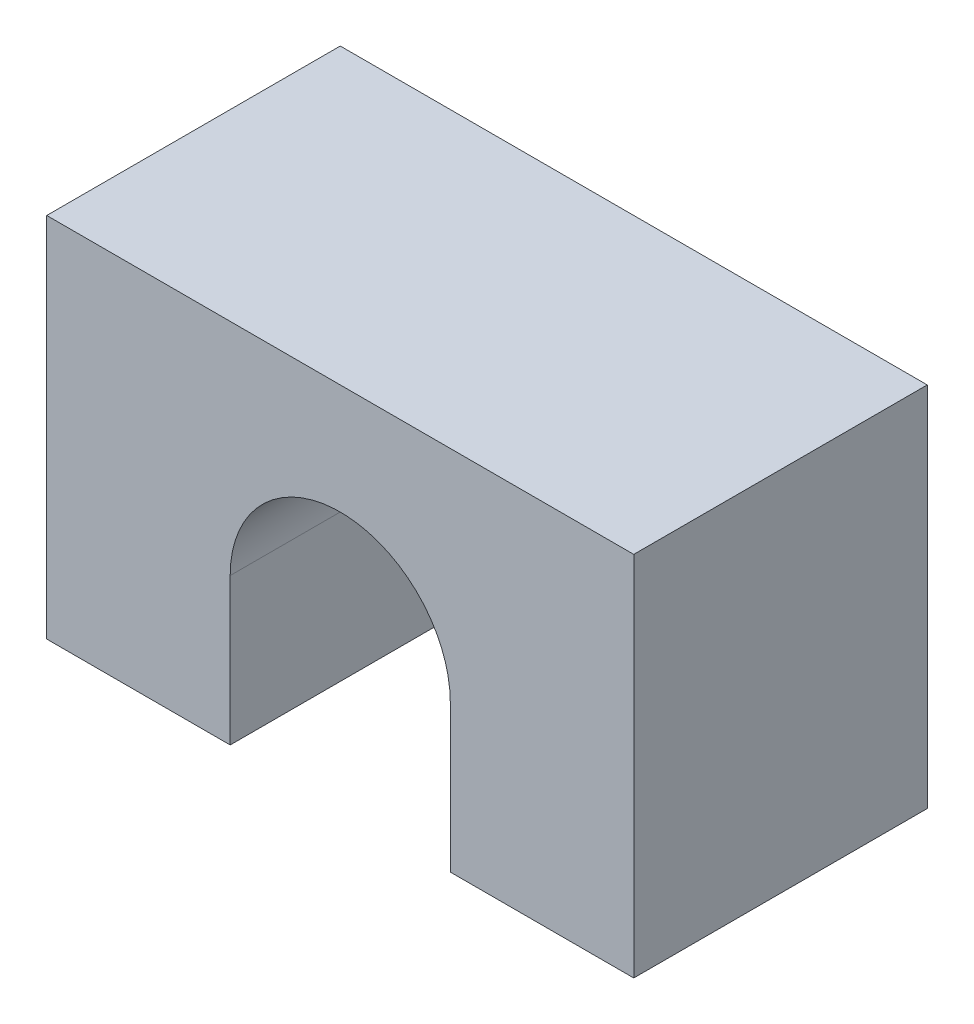
ISO-10303-21;
HEADER;
FILE_DESCRIPTION(('STEP AP214'),'2;1');
FILE_NAME('part.step','',(''),(''),'','','');
FILE_SCHEMA(('AUTOMOTIVE_DESIGN { 1 0 10303 214 1 1 1 1 }'));
ENDSEC;
DATA;
#1=APPLICATION_CONTEXT('core data for automotive mechanical design processes');
#2=APPLICATION_PROTOCOL_DEFINITION('international standard','automotive_design',2000,#1);
#3=PRODUCT_CONTEXT('',#1,'mechanical');
#4=PRODUCT('Part','Part','',(#3));
#5=PRODUCT_RELATED_PRODUCT_CATEGORY('part','',(#4));
#6=PRODUCT_DEFINITION_FORMATION('','',#4);
#7=PRODUCT_DEFINITION_CONTEXT('part definition',#1,'design');
#8=PRODUCT_DEFINITION('design','',#6,#7);
#9=PRODUCT_DEFINITION_SHAPE('','',#8);
#10=(LENGTH_UNIT() NAMED_UNIT(*) SI_UNIT(.MILLI.,.METRE.));
#11=(NAMED_UNIT(*) PLANE_ANGLE_UNIT() SI_UNIT($,.RADIAN.));
#12=(NAMED_UNIT(*) SI_UNIT($,.STERADIAN.) SOLID_ANGLE_UNIT());
#13=UNCERTAINTY_MEASURE_WITH_UNIT(LENGTH_MEASURE(1.E-05),#10,'distance_accuracy_value','');
#14=(GEOMETRIC_REPRESENTATION_CONTEXT(3) GLOBAL_UNCERTAINTY_ASSIGNED_CONTEXT((#13)) GLOBAL_UNIT_ASSIGNED_CONTEXT((#10,
#11,#12)) REPRESENTATION_CONTEXT('',''));
#15=CARTESIAN_POINT('',(0.,0.,0.));
#16=DIRECTION('',(0.,0.,1.));
#17=DIRECTION('',(1.,0.,0.));
#18=AXIS2_PLACEMENT_3D('',#15,#16,#17);
#19=CARTESIAN_POINT('',(0.,0.,8.));
#20=DIRECTION('',(0.,0.,-1.));
#21=DIRECTION('',(-1.,0.,0.));
#22=AXIS2_PLACEMENT_3D('',#19,#20,#21);
#23=CYLINDRICAL_SURFACE('',#22,3.);
#24=CARTESIAN_POINT('',(0.,0.,0.));
#25=DIRECTION('',(0.,0.,-1.));
#26=DIRECTION('',(1.,0.,0.));
#27=AXIS2_PLACEMENT_3D('',#24,#25,#26);
#28=CIRCLE('',#27,3.);
#29=CARTESIAN_POINT('',(-3.,0.,0.));
#30=VERTEX_POINT('',#29);
#31=CARTESIAN_POINT('',(3.,0.,0.));
#32=VERTEX_POINT('',#31);
#33=EDGE_CURVE('E129',#30,#32,#28,.T.);
#34=ORIENTED_EDGE('',*,*,#33,.T.);
#35=DIRECTION('',(0.,0.,-1.));
#36=VECTOR('',#35,1.);
#37=CARTESIAN_POINT('',(3.,0.,8.));
#38=LINE('',#37,#36);
#39=CARTESIAN_POINT('',(3.,0.,8.));
#40=VERTEX_POINT('',#39);
#41=EDGE_CURVE('E11',#40,#32,#38,.T.);
#42=ORIENTED_EDGE('',*,*,#41,.F.);
#43=CARTESIAN_POINT('',(0.,0.,8.));
#44=DIRECTION('',(0.,0.,-1.));
#45=DIRECTION('',(1.,0.,0.));
#46=AXIS2_PLACEMENT_3D('',#43,#44,#45);
#47=CIRCLE('',#46,3.);
#48=CARTESIAN_POINT('',(-3.,0.,8.));
#49=VERTEX_POINT('',#48);
#50=EDGE_CURVE('E143',#49,#40,#47,.T.);
#51=ORIENTED_EDGE('',*,*,#50,.F.);
#52=DIRECTION('',(0.,0.,-1.));
#53=VECTOR('',#52,1.);
#54=CARTESIAN_POINT('',(-3.,0.,8.));
#55=LINE('',#54,#53);
#56=EDGE_CURVE('E125',#49,#30,#55,.T.);
#57=ORIENTED_EDGE('',*,*,#56,.T.);
#58=EDGE_LOOP('',(#34,#42,#51,#57));
#59=FACE_BOUND('',#58,.T.);
#60=ADVANCED_FACE('F33',(#59),#23,.F.);
#61=CARTESIAN_POINT('',(3.,0.,8.));
#62=DIRECTION('',(1.,0.,0.));
#63=DIRECTION('',(0.,1.,0.));
#64=AXIS2_PLACEMENT_3D('',#61,#62,#63);
#65=PLANE('',#64);
#66=DIRECTION('',(0.,-1.,0.));
#67=VECTOR('',#66,1.);
#68=CARTESIAN_POINT('',(3.,0.,0.));
#69=LINE('',#68,#67);
#70=CARTESIAN_POINT('',(3.,-4.,0.));
#71=VERTEX_POINT('',#70);
#72=EDGE_CURVE('E132',#32,#71,#69,.T.);
#73=ORIENTED_EDGE('',*,*,#72,.T.);
#74=DIRECTION('',(0.,0.,-1.));
#75=VECTOR('',#74,1.);
#76=CARTESIAN_POINT('',(3.,-4.,8.));
#77=LINE('',#76,#75);
#78=CARTESIAN_POINT('',(3.,-4.,8.));
#79=VERTEX_POINT('',#78);
#80=EDGE_CURVE('E41',#79,#71,#77,.T.);
#81=ORIENTED_EDGE('',*,*,#80,.F.);
#82=DIRECTION('',(0.,-1.,0.));
#83=VECTOR('',#82,1.);
#84=CARTESIAN_POINT('',(3.,0.,8.));
#85=LINE('',#84,#83);
#86=EDGE_CURVE('E92',#40,#79,#85,.T.);
#87=ORIENTED_EDGE('',*,*,#86,.F.);
#88=ORIENTED_EDGE('',*,*,#41,.T.);
#89=EDGE_LOOP('',(#73,#81,#87,#88));
#90=FACE_BOUND('',#89,.T.);
#91=ADVANCED_FACE('F178',(#90),#65,.F.);
#92=CARTESIAN_POINT('',(3.,-4.,8.));
#93=DIRECTION('',(0.,1.,0.));
#94=DIRECTION('',(0.,0.,1.));
#95=AXIS2_PLACEMENT_3D('',#92,#93,#94);
#96=PLANE('',#95);
#97=DIRECTION('',(1.,0.,0.));
#98=VECTOR('',#97,1.);
#99=CARTESIAN_POINT('',(3.,-4.,0.));
#100=LINE('',#99,#98);
#101=CARTESIAN_POINT('',(8.,-4.,0.));
#102=VERTEX_POINT('',#101);
#103=EDGE_CURVE('E134',#71,#102,#100,.T.);
#104=ORIENTED_EDGE('',*,*,#103,.T.);
#105=DIRECTION('',(0.,0.,-1.));
#106=VECTOR('',#105,1.);
#107=CARTESIAN_POINT('',(8.,-4.,8.));
#108=LINE('',#107,#106);
#109=CARTESIAN_POINT('',(8.,-4.,8.));
#110=VERTEX_POINT('',#109);
#111=EDGE_CURVE('E150',#110,#102,#108,.T.);
#112=ORIENTED_EDGE('',*,*,#111,.F.);
#113=DIRECTION('',(1.,0.,0.));
#114=VECTOR('',#113,1.);
#115=CARTESIAN_POINT('',(3.,-4.,8.));
#116=LINE('',#115,#114);
#117=EDGE_CURVE('E158',#79,#110,#116,.T.);
#118=ORIENTED_EDGE('',*,*,#117,.F.);
#119=ORIENTED_EDGE('',*,*,#80,.T.);
#120=EDGE_LOOP('',(#104,#112,#118,#119));
#121=FACE_BOUND('',#120,.T.);
#122=ADVANCED_FACE('F156',(#121),#96,.F.);
#123=CARTESIAN_POINT('',(8.,-4.,8.));
#124=DIRECTION('',(-1.,0.,0.));
#125=DIRECTION('',(0.,0.,1.));
#126=AXIS2_PLACEMENT_3D('',#123,#124,#125);
#127=PLANE('',#126);
#128=DIRECTION('',(0.,1.,0.));
#129=VECTOR('',#128,1.);
#130=CARTESIAN_POINT('',(8.,-4.,0.));
#131=LINE('',#130,#129);
#132=CARTESIAN_POINT('',(8.,6.,0.));
#133=VERTEX_POINT('',#132);
#134=EDGE_CURVE('E136',#102,#133,#131,.T.);
#135=ORIENTED_EDGE('',*,*,#134,.T.);
#136=DIRECTION('',(0.,0.,-1.));
#137=VECTOR('',#136,1.);
#138=CARTESIAN_POINT('',(8.,6.,8.));
#139=LINE('',#138,#137);
#140=CARTESIAN_POINT('',(8.,6.,8.));
#141=VERTEX_POINT('',#140);
#142=EDGE_CURVE('E147',#141,#133,#139,.T.);
#143=ORIENTED_EDGE('',*,*,#142,.F.);
#144=DIRECTION('',(0.,1.,0.));
#145=VECTOR('',#144,1.);
#146=CARTESIAN_POINT('',(8.,-4.,8.));
#147=LINE('',#146,#145);
#148=EDGE_CURVE('E170',#110,#141,#147,.T.);
#149=ORIENTED_EDGE('',*,*,#148,.F.);
#150=ORIENTED_EDGE('',*,*,#111,.T.);
#151=EDGE_LOOP('',(#135,#143,#149,#150));
#152=FACE_BOUND('',#151,.T.);
#153=ADVANCED_FACE('F166',(#152),#127,.F.);
#154=CARTESIAN_POINT('',(8.,6.,8.));
#155=DIRECTION('',(0.,-1.,0.));
#156=DIRECTION('',(0.,0.,-1.));
#157=AXIS2_PLACEMENT_3D('',#154,#155,#156);
#158=PLANE('',#157);
#159=DIRECTION('',(-1.,0.,0.));
#160=VECTOR('',#159,1.);
#161=CARTESIAN_POINT('',(8.,6.,0.));
#162=LINE('',#161,#160);
#163=CARTESIAN_POINT('',(-8.,6.,0.));
#164=VERTEX_POINT('',#163);
#165=EDGE_CURVE('E138',#133,#164,#162,.T.);
#166=ORIENTED_EDGE('',*,*,#165,.T.);
#167=DIRECTION('',(0.,0.,-1.));
#168=VECTOR('',#167,1.);
#169=CARTESIAN_POINT('',(-8.,6.,8.));
#170=LINE('',#169,#168);
#171=CARTESIAN_POINT('',(-8.,6.,8.));
#172=VERTEX_POINT('',#171);
#173=EDGE_CURVE('E120',#172,#164,#170,.T.);
#174=ORIENTED_EDGE('',*,*,#173,.F.);
#175=DIRECTION('',(-1.,0.,0.));
#176=VECTOR('',#175,1.);
#177=CARTESIAN_POINT('',(8.,6.,8.));
#178=LINE('',#177,#176);
#179=EDGE_CURVE('E111',#141,#172,#178,.T.);
#180=ORIENTED_EDGE('',*,*,#179,.F.);
#181=ORIENTED_EDGE('',*,*,#142,.T.);
#182=EDGE_LOOP('',(#166,#174,#180,#181));
#183=FACE_BOUND('',#182,.T.);
#184=ADVANCED_FACE('F169',(#183),#158,.F.);
#185=CARTESIAN_POINT('',(-8.,6.,8.));
#186=DIRECTION('',(1.,0.,0.));
#187=DIRECTION('',(0.,1.,0.));
#188=AXIS2_PLACEMENT_3D('',#185,#186,#187);
#189=PLANE('',#188);
#190=DIRECTION('',(0.,-1.,0.));
#191=VECTOR('',#190,1.);
#192=CARTESIAN_POINT('',(-8.,6.,0.));
#193=LINE('',#192,#191);
#194=CARTESIAN_POINT('',(-8.,-4.,0.));
#195=VERTEX_POINT('',#194);
#196=EDGE_CURVE('E119',#164,#195,#193,.T.);
#197=ORIENTED_EDGE('',*,*,#196,.T.);
#198=DIRECTION('',(0.,0.,-1.));
#199=VECTOR('',#198,1.);
#200=CARTESIAN_POINT('',(-8.,-4.,8.));
#201=LINE('',#200,#199);
#202=CARTESIAN_POINT('',(-8.,-4.,8.));
#203=VERTEX_POINT('',#202);
#204=EDGE_CURVE('E116',#203,#195,#201,.T.);
#205=ORIENTED_EDGE('',*,*,#204,.F.);
#206=DIRECTION('',(0.,-1.,0.));
#207=VECTOR('',#206,1.);
#208=CARTESIAN_POINT('',(-8.,6.,8.));
#209=LINE('',#208,#207);
#210=EDGE_CURVE('E105',#172,#203,#209,.T.);
#211=ORIENTED_EDGE('',*,*,#210,.F.);
#212=ORIENTED_EDGE('',*,*,#173,.T.);
#213=EDGE_LOOP('',(#197,#205,#211,#212));
#214=FACE_BOUND('',#213,.T.);
#215=ADVANCED_FACE('F117',(#214),#189,.F.);
#216=CARTESIAN_POINT('',(-8.,-4.,8.));
#217=DIRECTION('',(0.,1.,0.));
#218=DIRECTION('',(0.,0.,1.));
#219=AXIS2_PLACEMENT_3D('',#216,#217,#218);
#220=PLANE('',#219);
#221=DIRECTION('',(1.,0.,0.));
#222=VECTOR('',#221,1.);
#223=CARTESIAN_POINT('',(-8.,-4.,0.));
#224=LINE('',#223,#222);
#225=CARTESIAN_POINT('',(-3.,-4.,0.));
#226=VERTEX_POINT('',#225);
#227=EDGE_CURVE('E78',#195,#226,#224,.T.);
#228=ORIENTED_EDGE('',*,*,#227,.T.);
#229=DIRECTION('',(0.,0.,-1.));
#230=VECTOR('',#229,1.);
#231=CARTESIAN_POINT('',(-3.,-4.,8.));
#232=LINE('',#231,#230);
#233=CARTESIAN_POINT('',(-3.,-4.,8.));
#234=VERTEX_POINT('',#233);
#235=EDGE_CURVE('E121',#234,#226,#232,.T.);
#236=ORIENTED_EDGE('',*,*,#235,.F.);
#237=DIRECTION('',(1.,0.,0.));
#238=VECTOR('',#237,1.);
#239=CARTESIAN_POINT('',(-8.,-4.,8.));
#240=LINE('',#239,#238);
#241=EDGE_CURVE('E109',#203,#234,#240,.T.);
#242=ORIENTED_EDGE('',*,*,#241,.F.);
#243=ORIENTED_EDGE('',*,*,#204,.T.);
#244=EDGE_LOOP('',(#228,#236,#242,#243));
#245=FACE_BOUND('',#244,.T.);
#246=ADVANCED_FACE('F123',(#245),#220,.F.);
#247=CARTESIAN_POINT('',(-3.,0.,8.));
#248=DIRECTION('',(-1.,0.,0.));
#249=DIRECTION('',(0.,-1.,0.));
#250=AXIS2_PLACEMENT_3D('',#247,#248,#249);
#251=PLANE('',#250);
#252=DIRECTION('',(0.,1.,0.));
#253=VECTOR('',#252,1.);
#254=CARTESIAN_POINT('',(-3.,0.,0.));
#255=LINE('',#254,#253);
#256=EDGE_CURVE('E84',#226,#30,#255,.T.);
#257=ORIENTED_EDGE('',*,*,#256,.T.);
#258=ORIENTED_EDGE('',*,*,#56,.F.);
#259=DIRECTION('',(0.,1.,0.));
#260=VECTOR('',#259,1.);
#261=CARTESIAN_POINT('',(-3.,0.,8.));
#262=LINE('',#261,#260);
#263=EDGE_CURVE('E49',#234,#49,#262,.T.);
#264=ORIENTED_EDGE('',*,*,#263,.F.);
#265=ORIENTED_EDGE('',*,*,#235,.T.);
#266=EDGE_LOOP('',(#257,#258,#264,#265));
#267=FACE_BOUND('',#266,.T.);
#268=ADVANCED_FACE('F194',(#267),#251,.F.);
#269=CARTESIAN_POINT('',(0.,0.,8.));
#270=DIRECTION('',(0.,0.,1.));
#271=DIRECTION('',(1.,0.,0.));
#272=AXIS2_PLACEMENT_3D('',#269,#270,#271);
#273=PLANE('',#272);
#274=ORIENTED_EDGE('',*,*,#50,.T.);
#275=ORIENTED_EDGE('',*,*,#86,.T.);
#276=ORIENTED_EDGE('',*,*,#117,.T.);
#277=ORIENTED_EDGE('',*,*,#148,.T.);
#278=ORIENTED_EDGE('',*,*,#179,.T.);
#279=ORIENTED_EDGE('',*,*,#210,.T.);
#280=ORIENTED_EDGE('',*,*,#241,.T.);
#281=ORIENTED_EDGE('',*,*,#263,.T.);
#282=EDGE_LOOP('',(#274,#275,#276,#277,#278,#279,#280,#281));
#283=FACE_BOUND('',#282,.T.);
#284=ADVANCED_FACE('F107',(#283),#273,.T.);
#285=CARTESIAN_POINT('',(0.,0.,0.));
#286=DIRECTION('',(0.,0.,1.));
#287=DIRECTION('',(1.,0.,0.));
#288=AXIS2_PLACEMENT_3D('',#285,#286,#287);
#289=PLANE('',#288);
#290=ORIENTED_EDGE('',*,*,#33,.F.);
#291=ORIENTED_EDGE('',*,*,#256,.F.);
#292=ORIENTED_EDGE('',*,*,#227,.F.);
#293=ORIENTED_EDGE('',*,*,#196,.F.);
#294=ORIENTED_EDGE('',*,*,#165,.F.);
#295=ORIENTED_EDGE('',*,*,#134,.F.);
#296=ORIENTED_EDGE('',*,*,#103,.F.);
#297=ORIENTED_EDGE('',*,*,#72,.F.);
#298=EDGE_LOOP('',(#290,#291,#292,#293,#294,#295,#296,#297));
#299=FACE_BOUND('',#298,.T.);
#300=ADVANCED_FACE('F162',(#299),#289,.F.);
#301=CLOSED_SHELL('',(#60,#91,#122,#153,#184,#215,#246,#268,#284,#300));
#302=MANIFOLD_SOLID_BREP('B2',#301);
#303=ADVANCED_BREP_SHAPE_REPRESENTATION('',(#18,#302),#14);
#304=SHAPE_DEFINITION_REPRESENTATION(#9,#303);
ENDSEC;
END-ISO-10303-21;
